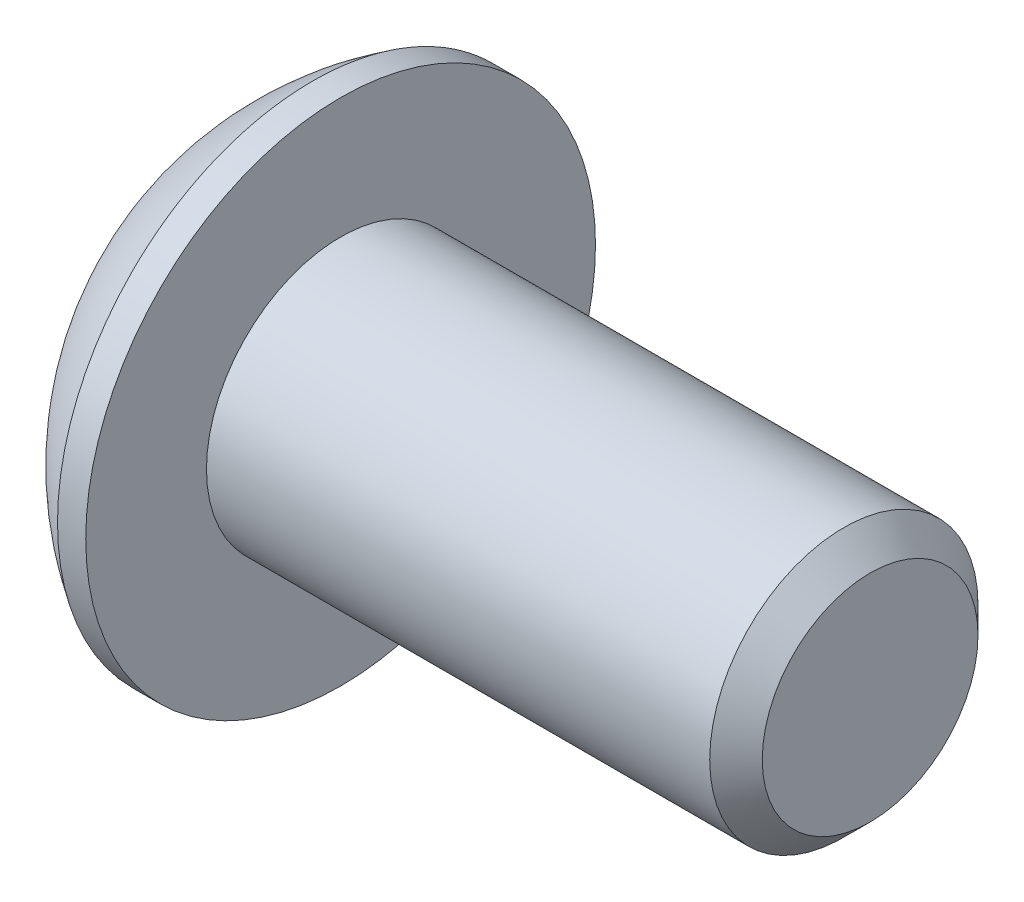
ISO-10303-21;
HEADER;
FILE_DESCRIPTION(('STEP AP214'),'2;1');
FILE_NAME('part.step','',(''),(''),'','','');
FILE_SCHEMA(('AUTOMOTIVE_DESIGN { 1 0 10303 214 1 1 1 1 }'));
ENDSEC;
DATA;
#1=APPLICATION_CONTEXT('core data for automotive mechanical design processes');
#2=APPLICATION_PROTOCOL_DEFINITION('international standard','automotive_design',2000,#1);
#3=PRODUCT_CONTEXT('',#1,'mechanical');
#4=PRODUCT('Part','Part','',(#3));
#5=PRODUCT_RELATED_PRODUCT_CATEGORY('part','',(#4));
#6=PRODUCT_DEFINITION_FORMATION('','',#4);
#7=PRODUCT_DEFINITION_CONTEXT('part definition',#1,'design');
#8=PRODUCT_DEFINITION('design','',#6,#7);
#9=PRODUCT_DEFINITION_SHAPE('','',#8);
#10=(LENGTH_UNIT() NAMED_UNIT(*) SI_UNIT(.MILLI.,.METRE.));
#11=(NAMED_UNIT(*) PLANE_ANGLE_UNIT() SI_UNIT($,.RADIAN.));
#12=(NAMED_UNIT(*) SI_UNIT($,.STERADIAN.) SOLID_ANGLE_UNIT());
#13=UNCERTAINTY_MEASURE_WITH_UNIT(LENGTH_MEASURE(1.E-05),#10,'distance_accuracy_value','');
#14=(GEOMETRIC_REPRESENTATION_CONTEXT(3) GLOBAL_UNCERTAINTY_ASSIGNED_CONTEXT((#13)) GLOBAL_UNIT_ASSIGNED_CONTEXT((#10,
#11,#12)) REPRESENTATION_CONTEXT('',''));
#15=CARTESIAN_POINT('',(0.,0.,0.));
#16=DIRECTION('',(0.,0.,1.));
#17=DIRECTION('',(1.,0.,0.));
#18=AXIS2_PLACEMENT_3D('',#15,#16,#17);
#19=CARTESIAN_POINT('',(1.77800000000006,0.,0.));
#20=DIRECTION('',(-1.,0.,0.));
#21=DIRECTION('',(0.,0.,1.));
#22=AXIS2_PLACEMENT_3D('',#19,#20,#21);
#23=CONICAL_SURFACE('',#22,1.58750000000007,1.04719755119647);
#24=CARTESIAN_POINT('',(2.69454355233878,0.,0.));
#25=VERTEX_POINT('',#24);
#26=VERTEX_LOOP('',#25);
#27=FACE_BOUND('',#26,.T.);
#28=CARTESIAN_POINT('',(1.77800000000006,0.,0.));
#29=DIRECTION('',(-1.,0.,0.));
#30=DIRECTION('',(0.,0.,1.));
#31=AXIS2_PLACEMENT_3D('',#28,#29,#30);
#32=CIRCLE('',#31,1.58750000000007);
#33=CARTESIAN_POINT('',(1.77800000000003,0.,1.58750000000004));
#34=VERTEX_POINT('',#33);
#35=CARTESIAN_POINT('',(1.77800000000003,-1.37481532850783,0.793750000000017));
#36=VERTEX_POINT('',#35);
#37=EDGE_CURVE('E19',#34,#36,#32,.F.);
#38=ORIENTED_EDGE('',*,*,#37,.F.);
#39=CARTESIAN_POINT('',(1.77800000000006,0.,0.));
#40=DIRECTION('',(-1.,0.,0.));
#41=DIRECTION('',(0.,0.,1.));
#42=AXIS2_PLACEMENT_3D('',#39,#40,#41);
#43=CIRCLE('',#42,1.58750000000007);
#44=CARTESIAN_POINT('',(1.77800000000003,1.37481532850783,0.793750000000019));
#45=VERTEX_POINT('',#44);
#46=EDGE_CURVE('E89',#34,#45,#43,.T.);
#47=ORIENTED_EDGE('',*,*,#46,.T.);
#48=CARTESIAN_POINT('',(1.77800000000006,0.,0.));
#49=DIRECTION('',(-1.,0.,0.));
#50=DIRECTION('',(0.,0.,1.));
#51=AXIS2_PLACEMENT_3D('',#48,#49,#50);
#52=CIRCLE('',#51,1.58750000000007);
#53=CARTESIAN_POINT('',(1.77800000000003,1.37481532850783,-0.793750000000019));
#54=VERTEX_POINT('',#53);
#55=EDGE_CURVE('E105',#45,#54,#52,.T.);
#56=ORIENTED_EDGE('',*,*,#55,.T.);
#57=CARTESIAN_POINT('',(1.77800000000006,0.,0.));
#58=DIRECTION('',(-1.,0.,0.));
#59=DIRECTION('',(0.,0.,1.));
#60=AXIS2_PLACEMENT_3D('',#57,#58,#59);
#61=CIRCLE('',#60,1.58750000000007);
#62=CARTESIAN_POINT('',(1.77800000000003,-2.78602967841758E-12,-1.58750000000004));
#63=VERTEX_POINT('',#62);
#64=EDGE_CURVE('E448',#54,#63,#61,.T.);
#65=ORIENTED_EDGE('',*,*,#64,.T.);
#66=CARTESIAN_POINT('',(1.77800000000006,0.,0.));
#67=DIRECTION('',(-1.,0.,0.));
#68=DIRECTION('',(0.,0.,1.));
#69=AXIS2_PLACEMENT_3D('',#66,#67,#68);
#70=CIRCLE('',#69,1.58750000000007);
#71=CARTESIAN_POINT('',(1.77800000000003,-1.37481532850783,-0.793750000000017));
#72=VERTEX_POINT('',#71);
#73=EDGE_CURVE('E450',#72,#63,#70,.F.);
#74=ORIENTED_EDGE('',*,*,#73,.F.);
#75=CARTESIAN_POINT('',(1.77800000000006,0.,0.));
#76=DIRECTION('',(-1.,0.,0.));
#77=DIRECTION('',(0.,0.,1.));
#78=AXIS2_PLACEMENT_3D('',#75,#76,#77);
#79=CIRCLE('',#78,1.58750000000007);
#80=EDGE_CURVE('E92',#36,#72,#79,.F.);
#81=ORIENTED_EDGE('',*,*,#80,.F.);
#82=EDGE_LOOP('',(#38,#47,#56,#65,#74,#81));
#83=FACE_BOUND('',#82,.T.);
#84=ADVANCED_FACE('F16',(#27,#83),#23,.F.);
#85=CARTESIAN_POINT('',(1.778,-2.74963065701559,-1.5875));
#86=DIRECTION('',(1.,0.,0.));
#87=DIRECTION('',(0.,0.,-1.));
#88=AXIS2_PLACEMENT_3D('',#85,#86,#87);
#89=PLANE('',#88);
#90=DIRECTION('',(0.,0.5,0.866025403784439));
#91=VECTOR('',#90,1.);
#92=CARTESIAN_POINT('',(1.778,-1.83308710467706,0.));
#93=LINE('',#92,#91);
#94=CARTESIAN_POINT('',(1.778,-0.91654355233853,1.5875));
#95=VERTEX_POINT('',#94);
#96=EDGE_CURVE('E110',#95,#36,#93,.F.);
#97=ORIENTED_EDGE('',*,*,#96,.F.);
#98=DIRECTION('',(0.,1.,0.));
#99=VECTOR('',#98,1.);
#100=CARTESIAN_POINT('',(1.778,-0.91654355233853,1.5875));
#101=LINE('',#100,#99);
#102=EDGE_CURVE('E108',#34,#95,#101,.F.);
#103=ORIENTED_EDGE('',*,*,#102,.F.);
#104=ORIENTED_EDGE('',*,*,#37,.T.);
#105=EDGE_LOOP('',(#97,#103,#104));
#106=FACE_BOUND('',#105,.T.);
#107=ADVANCED_FACE('F109',(#106),#89,.F.);
#108=CARTESIAN_POINT('',(1.778,-2.74963065701559,-1.5875));
#109=DIRECTION('',(1.,0.,0.));
#110=DIRECTION('',(0.,0.,-1.));
#111=AXIS2_PLACEMENT_3D('',#108,#109,#110);
#112=PLANE('',#111);
#113=DIRECTION('',(0.,-0.5,0.866025403784439));
#114=VECTOR('',#113,1.);
#115=CARTESIAN_POINT('',(1.778,-0.91654355233853,-1.5875));
#116=LINE('',#115,#114);
#117=CARTESIAN_POINT('',(1.778,-1.83308710467706,0.));
#118=VERTEX_POINT('',#117);
#119=EDGE_CURVE('E158',#118,#72,#116,.F.);
#120=ORIENTED_EDGE('',*,*,#119,.F.);
#121=DIRECTION('',(0.,0.5,0.866025403784439));
#122=VECTOR('',#121,1.);
#123=CARTESIAN_POINT('',(1.778,-1.83308710467706,0.));
#124=LINE('',#123,#122);
#125=EDGE_CURVE('E170',#36,#118,#124,.F.);
#126=ORIENTED_EDGE('',*,*,#125,.F.);
#127=ORIENTED_EDGE('',*,*,#80,.T.);
#128=EDGE_LOOP('',(#120,#126,#127));
#129=FACE_BOUND('',#128,.T.);
#130=ADVANCED_FACE('F247',(#129),#112,.F.);
#131=CARTESIAN_POINT('',(1.778,-2.74963065701559,-1.5875));
#132=DIRECTION('',(1.,0.,0.));
#133=DIRECTION('',(0.,0.,-1.));
#134=AXIS2_PLACEMENT_3D('',#131,#132,#133);
#135=PLANE('',#134);
#136=DIRECTION('',(0.,1.,0.));
#137=VECTOR('',#136,1.);
#138=CARTESIAN_POINT('',(1.778,0.916543552338532,-1.5875));
#139=LINE('',#138,#137);
#140=CARTESIAN_POINT('',(1.778,-0.91654355233853,-1.5875));
#141=VERTEX_POINT('',#140);
#142=EDGE_CURVE('E142',#141,#63,#139,.T.);
#143=ORIENTED_EDGE('',*,*,#142,.F.);
#144=DIRECTION('',(0.,-0.5,0.866025403784439));
#145=VECTOR('',#144,1.);
#146=CARTESIAN_POINT('',(1.778,-0.91654355233853,-1.5875));
#147=LINE('',#146,#145);
#148=EDGE_CURVE('E155',#72,#141,#147,.F.);
#149=ORIENTED_EDGE('',*,*,#148,.F.);
#150=ORIENTED_EDGE('',*,*,#73,.T.);
#151=EDGE_LOOP('',(#143,#149,#150));
#152=FACE_BOUND('',#151,.T.);
#153=ADVANCED_FACE('F243',(#152),#135,.F.);
#154=CARTESIAN_POINT('',(1.778,-2.74963065701559,-1.5875));
#155=DIRECTION('',(1.,0.,0.));
#156=DIRECTION('',(0.,0.,-1.));
#157=AXIS2_PLACEMENT_3D('',#154,#155,#156);
#158=PLANE('',#157);
#159=DIRECTION('',(0.,-0.5,-0.866025403784439));
#160=VECTOR('',#159,1.);
#161=CARTESIAN_POINT('',(1.778,1.83308710467706,0.));
#162=LINE('',#161,#160);
#163=CARTESIAN_POINT('',(1.778,0.916543552338532,-1.5875));
#164=VERTEX_POINT('',#163);
#165=EDGE_CURVE('E127',#164,#54,#162,.F.);
#166=ORIENTED_EDGE('',*,*,#165,.F.);
#167=DIRECTION('',(0.,1.,0.));
#168=VECTOR('',#167,1.);
#169=CARTESIAN_POINT('',(1.778,0.916543552338532,-1.5875));
#170=LINE('',#169,#168);
#171=EDGE_CURVE('E139',#63,#164,#170,.T.);
#172=ORIENTED_EDGE('',*,*,#171,.F.);
#173=ORIENTED_EDGE('',*,*,#64,.F.);
#174=EDGE_LOOP('',(#166,#172,#173));
#175=FACE_BOUND('',#174,.T.);
#176=ADVANCED_FACE('F239',(#175),#158,.F.);
#177=CARTESIAN_POINT('',(1.778,-2.74963065701559,-1.5875));
#178=DIRECTION('',(1.,0.,0.));
#179=DIRECTION('',(0.,0.,-1.));
#180=AXIS2_PLACEMENT_3D('',#177,#178,#179);
#181=PLANE('',#180);
#182=DIRECTION('',(0.,0.5,-0.866025403784439));
#183=VECTOR('',#182,1.);
#184=CARTESIAN_POINT('',(1.778,0.916543552338533,1.5875));
#185=LINE('',#184,#183);
#186=CARTESIAN_POINT('',(1.778,1.83308710467706,0.));
#187=VERTEX_POINT('',#186);
#188=EDGE_CURVE('E147',#187,#45,#185,.F.);
#189=ORIENTED_EDGE('',*,*,#188,.F.);
#190=DIRECTION('',(0.,-0.5,-0.866025403784439));
#191=VECTOR('',#190,1.);
#192=CARTESIAN_POINT('',(1.778,1.83308710467706,0.));
#193=LINE('',#192,#191);
#194=EDGE_CURVE('E124',#54,#187,#193,.F.);
#195=ORIENTED_EDGE('',*,*,#194,.F.);
#196=ORIENTED_EDGE('',*,*,#55,.F.);
#197=EDGE_LOOP('',(#189,#195,#196));
#198=FACE_BOUND('',#197,.T.);
#199=ADVANCED_FACE('F236',(#198),#181,.F.);
#200=CARTESIAN_POINT('',(1.778,-2.74963065701559,-1.5875));
#201=DIRECTION('',(1.,0.,0.));
#202=DIRECTION('',(0.,0.,-1.));
#203=AXIS2_PLACEMENT_3D('',#200,#201,#202);
#204=PLANE('',#203);
#205=DIRECTION('',(0.,1.,0.));
#206=VECTOR('',#205,1.);
#207=CARTESIAN_POINT('',(1.778,-0.91654355233853,1.5875));
#208=LINE('',#207,#206);
#209=CARTESIAN_POINT('',(1.778,0.916543552338533,1.5875));
#210=VERTEX_POINT('',#209);
#211=EDGE_CURVE('E100',#210,#34,#208,.F.);
#212=ORIENTED_EDGE('',*,*,#211,.F.);
#213=DIRECTION('',(0.,0.5,-0.866025403784439));
#214=VECTOR('',#213,1.);
#215=CARTESIAN_POINT('',(1.778,0.916543552338533,1.5875));
#216=LINE('',#215,#214);
#217=EDGE_CURVE('E103',#45,#210,#216,.F.);
#218=ORIENTED_EDGE('',*,*,#217,.F.);
#219=ORIENTED_EDGE('',*,*,#46,.F.);
#220=EDGE_LOOP('',(#212,#218,#219));
#221=FACE_BOUND('',#220,.T.);
#222=ADVANCED_FACE('F98',(#221),#204,.F.);
#223=CARTESIAN_POINT('',(1.778,-0.91654355233853,1.5875));
#224=DIRECTION('',(0.,0.,-1.));
#225=DIRECTION('',(0.,1.,0.));
#226=AXIS2_PLACEMENT_3D('',#223,#224,#225);
#227=PLANE('',#226);
#228=DIRECTION('',(0.,1.,0.));
#229=VECTOR('',#228,1.);
#230=CARTESIAN_POINT('',(0.,0.,1.5875));
#231=LINE('',#230,#229);
#232=CARTESIAN_POINT('',(0.,0.916543552338532,1.5875));
#233=VERTEX_POINT('',#232);
#234=CARTESIAN_POINT('',(0.,-0.91654355233853,1.5875));
#235=VERTEX_POINT('',#234);
#236=EDGE_CURVE('E131',#233,#235,#231,.F.);
#237=ORIENTED_EDGE('',*,*,#236,.F.);
#238=DIRECTION('',(1.,0.,0.));
#239=VECTOR('',#238,1.);
#240=CARTESIAN_POINT('',(1.778,0.916543552338533,1.5875));
#241=LINE('',#240,#239);
#242=EDGE_CURVE('E116',#210,#233,#241,.F.);
#243=ORIENTED_EDGE('',*,*,#242,.F.);
#244=ORIENTED_EDGE('',*,*,#211,.T.);
#245=ORIENTED_EDGE('',*,*,#102,.T.);
#246=DIRECTION('',(1.,0.,0.));
#247=VECTOR('',#246,1.);
#248=CARTESIAN_POINT('',(1.778,-0.91654355233853,1.5875));
#249=LINE('',#248,#247);
#250=EDGE_CURVE('E167',#235,#95,#249,.T.);
#251=ORIENTED_EDGE('',*,*,#250,.F.);
#252=EDGE_LOOP('',(#237,#243,#244,#245,#251));
#253=FACE_BOUND('',#252,.T.);
#254=ADVANCED_FACE('F114',(#253),#227,.T.);
#255=CARTESIAN_POINT('',(1.778,-1.83308710467706,0.));
#256=DIRECTION('',(0.,0.866025403784439,-0.5));
#257=DIRECTION('',(0.,0.5,0.866025403784439));
#258=AXIS2_PLACEMENT_3D('',#255,#256,#257);
#259=PLANE('',#258);
#260=DIRECTION('',(0.,-0.5,-0.866025403784439));
#261=VECTOR('',#260,1.);
#262=CARTESIAN_POINT('',(0.,-0.91654355233853,1.5875));
#263=LINE('',#262,#261);
#264=CARTESIAN_POINT('',(0.,-1.83308710467706,0.));
#265=VERTEX_POINT('',#264);
#266=EDGE_CURVE('E434',#235,#265,#263,.T.);
#267=ORIENTED_EDGE('',*,*,#266,.F.);
#268=ORIENTED_EDGE('',*,*,#250,.T.);
#269=ORIENTED_EDGE('',*,*,#96,.T.);
#270=ORIENTED_EDGE('',*,*,#125,.T.);
#271=DIRECTION('',(1.,0.,0.));
#272=VECTOR('',#271,1.);
#273=CARTESIAN_POINT('',(1.778,-1.83308710467706,0.));
#274=LINE('',#273,#272);
#275=EDGE_CURVE('E152',#265,#118,#274,.T.);
#276=ORIENTED_EDGE('',*,*,#275,.F.);
#277=EDGE_LOOP('',(#267,#268,#269,#270,#276));
#278=FACE_BOUND('',#277,.T.);
#279=ADVANCED_FACE('F227',(#278),#259,.T.);
#280=CARTESIAN_POINT('',(1.778,-0.91654355233853,-1.5875));
#281=DIRECTION('',(0.,0.866025403784439,0.5));
#282=DIRECTION('',(0.,-0.5,0.866025403784439));
#283=AXIS2_PLACEMENT_3D('',#280,#281,#282);
#284=PLANE('',#283);
#285=DIRECTION('',(0.,0.5,-0.866025403784439));
#286=VECTOR('',#285,1.);
#287=CARTESIAN_POINT('',(0.,-1.83308710467706,0.));
#288=LINE('',#287,#286);
#289=CARTESIAN_POINT('',(0.,-0.91654355233853,-1.5875));
#290=VERTEX_POINT('',#289);
#291=EDGE_CURVE('E431',#265,#290,#288,.T.);
#292=ORIENTED_EDGE('',*,*,#291,.F.);
#293=ORIENTED_EDGE('',*,*,#275,.T.);
#294=ORIENTED_EDGE('',*,*,#119,.T.);
#295=ORIENTED_EDGE('',*,*,#148,.T.);
#296=DIRECTION('',(1.,0.,0.));
#297=VECTOR('',#296,1.);
#298=CARTESIAN_POINT('',(1.778,-0.91654355233853,-1.5875));
#299=LINE('',#298,#297);
#300=EDGE_CURVE('E136',#290,#141,#299,.T.);
#301=ORIENTED_EDGE('',*,*,#300,.F.);
#302=EDGE_LOOP('',(#292,#293,#294,#295,#301));
#303=FACE_BOUND('',#302,.T.);
#304=ADVANCED_FACE('F223',(#303),#284,.T.);
#305=CARTESIAN_POINT('',(1.778,0.916543552338532,-1.5875));
#306=DIRECTION('',(0.,0.,1.));
#307=DIRECTION('',(1.,0.,0.));
#308=AXIS2_PLACEMENT_3D('',#305,#306,#307);
#309=PLANE('',#308);
#310=DIRECTION('',(0.,1.,0.));
#311=VECTOR('',#310,1.);
#312=CARTESIAN_POINT('',(0.,0.,-1.5875));
#313=LINE('',#312,#311);
#314=CARTESIAN_POINT('',(0.,0.916543552338532,-1.5875));
#315=VERTEX_POINT('',#314);
#316=EDGE_CURVE('E428',#290,#315,#313,.T.);
#317=ORIENTED_EDGE('',*,*,#316,.F.);
#318=ORIENTED_EDGE('',*,*,#300,.T.);
#319=ORIENTED_EDGE('',*,*,#142,.T.);
#320=ORIENTED_EDGE('',*,*,#171,.T.);
#321=DIRECTION('',(1.,0.,0.));
#322=VECTOR('',#321,1.);
#323=CARTESIAN_POINT('',(1.778,0.916543552338532,-1.5875));
#324=LINE('',#323,#322);
#325=EDGE_CURVE('E126',#315,#164,#324,.T.);
#326=ORIENTED_EDGE('',*,*,#325,.F.);
#327=EDGE_LOOP('',(#317,#318,#319,#320,#326));
#328=FACE_BOUND('',#327,.T.);
#329=ADVANCED_FACE('F220',(#328),#309,.T.);
#330=CARTESIAN_POINT('',(1.778,1.83308710467706,0.));
#331=DIRECTION('',(0.,-0.866025403784439,0.5));
#332=DIRECTION('',(0.,-0.5,-0.866025403784439));
#333=AXIS2_PLACEMENT_3D('',#330,#331,#332);
#334=PLANE('',#333);
#335=DIRECTION('',(0.,0.5,0.866025403784438));
#336=VECTOR('',#335,1.);
#337=CARTESIAN_POINT('',(0.,0.916543552338532,-1.5875));
#338=LINE('',#337,#336);
#339=CARTESIAN_POINT('',(0.,1.83308710467706,0.));
#340=VERTEX_POINT('',#339);
#341=EDGE_CURVE('E425',#315,#340,#338,.T.);
#342=ORIENTED_EDGE('',*,*,#341,.F.);
#343=ORIENTED_EDGE('',*,*,#325,.T.);
#344=ORIENTED_EDGE('',*,*,#165,.T.);
#345=ORIENTED_EDGE('',*,*,#194,.T.);
#346=DIRECTION('',(1.,0.,0.));
#347=VECTOR('',#346,1.);
#348=CARTESIAN_POINT('',(1.778,1.83308710467706,0.));
#349=LINE('',#348,#347);
#350=EDGE_CURVE('E34',#340,#187,#349,.T.);
#351=ORIENTED_EDGE('',*,*,#350,.F.);
#352=EDGE_LOOP('',(#342,#343,#344,#345,#351));
#353=FACE_BOUND('',#352,.T.);
#354=ADVANCED_FACE('F216',(#353),#334,.T.);
#355=CARTESIAN_POINT('',(1.778,0.916543552338533,1.5875));
#356=DIRECTION('',(0.,-0.866025403784439,-0.5));
#357=DIRECTION('',(0.,0.5,-0.866025403784439));
#358=AXIS2_PLACEMENT_3D('',#355,#356,#357);
#359=PLANE('',#358);
#360=DIRECTION('',(0.,-0.5,0.866025403784439));
#361=VECTOR('',#360,1.);
#362=CARTESIAN_POINT('',(0.,1.83308710467706,0.));
#363=LINE('',#362,#361);
#364=EDGE_CURVE('E202',#340,#233,#363,.T.);
#365=ORIENTED_EDGE('',*,*,#364,.F.);
#366=ORIENTED_EDGE('',*,*,#350,.T.);
#367=ORIENTED_EDGE('',*,*,#188,.T.);
#368=ORIENTED_EDGE('',*,*,#217,.T.);
#369=ORIENTED_EDGE('',*,*,#242,.T.);
#370=EDGE_LOOP('',(#365,#366,#367,#368,#369));
#371=FACE_BOUND('',#370,.T.);
#372=ADVANCED_FACE('F212',(#371),#359,.T.);
#373=CARTESIAN_POINT('',(0.,0.,0.));
#374=DIRECTION('',(-1.,0.,0.));
#375=DIRECTION('',(0.,0.,1.));
#376=AXIS2_PLACEMENT_3D('',#373,#374,#375);
#377=PLANE('',#376);
#378=ORIENTED_EDGE('',*,*,#341,.T.);
#379=ORIENTED_EDGE('',*,*,#364,.T.);
#380=ORIENTED_EDGE('',*,*,#236,.T.);
#381=ORIENTED_EDGE('',*,*,#266,.T.);
#382=ORIENTED_EDGE('',*,*,#291,.T.);
#383=ORIENTED_EDGE('',*,*,#316,.T.);
#384=EDGE_LOOP('',(#378,#379,#380,#381,#382,#383));
#385=FACE_BOUND('',#384,.T.);
#386=CARTESIAN_POINT('',(0.,2.29235,0.));
#387=CARTESIAN_POINT('',(0.,2.29234961429956,0.0643619991867155));
#388=CARTESIAN_POINT('',(0.,2.28963695190107,0.128735826629365));
#389=CARTESIAN_POINT('',(0.,2.27880393843647,0.257038618985286));
#390=CARTESIAN_POINT('',(0.,2.27068199085126,0.320967446929162));
#391=CARTESIAN_POINT('',(0.,2.24906694794255,0.448021254607717));
#392=CARTESIAN_POINT('',(-2.10840056970795E-13,2.2355653265346,0.51114479338186));
#393=CARTESIAN_POINT('',(2.11879226109671E-13,2.20328400495644,0.636065176149321));
#394=CARTESIAN_POINT('',(7.89917625163527E-13,2.18450002159113,0.697860899533934));
#395=CARTESIAN_POINT('',(1.31285126424162E-12,2.12048422735802,0.880329802927747));
#396=CARTESIAN_POINT('',(0.,2.06753599079459,0.998391795928116));
#397=CARTESIAN_POINT('',(0.,1.94254204858672,1.22393765942147));
#398=CARTESIAN_POINT('',(1.0943500696831E-12,1.87049561696642,1.33142112758208));
#399=CARTESIAN_POINT('',(6.78225420709987E-13,1.7497425419488,1.48237719670935));
#400=CARTESIAN_POINT('',(1.81996039545648E-13,1.707345731323,1.53101280076737));
#401=CARTESIAN_POINT('',(-1.80953624347813E-13,1.61863910291529,1.62450601319185));
#402=CARTESIAN_POINT('',(0.,1.57233309727312,1.66936721890417));
#403=CARTESIAN_POINT('',(0.,1.47608431707233,1.7550488420402));
#404=CARTESIAN_POINT('',(0.,1.42613990458994,1.79586741981512));
#405=CARTESIAN_POINT('',(0.,1.3229945254125,1.87315615311522));
#406=CARTESIAN_POINT('',(0.,1.26979280714187,1.90962529930697));
#407=CARTESIAN_POINT('',(0.,1.10588180153952,2.01207722151089));
#408=CARTESIAN_POINT('',(0.,0.990764947001307,2.07119486286666));
#409=CARTESIAN_POINT('',(0.,0.752302198839713,2.16922858468856));
#410=CARTESIAN_POINT('',(0.,0.628956393121256,2.20814488091449));
#411=CARTESIAN_POINT('',(0.,0.377466101733266,2.2647275576592));
#412=CARTESIAN_POINT('',(0.,0.249321590440377,2.28239382469379));
#413=CARTESIAN_POINT('',(0.,-0.00811435371610997,2.29595665980955));
#414=CARTESIAN_POINT('',(0.,-0.137405786579708,2.29185322789072));
#415=CARTESIAN_POINT('',(0.,-0.393449386933728,2.2620096240906));
#416=CARTESIAN_POINT('',(0.,-0.520201567981086,2.23626956775766));
#417=CARTESIAN_POINT('',(0.,-0.767645294384453,2.16383549332687));
#418=CARTESIAN_POINT('',(0.,-0.888336774993558,2.11714125142685));
#419=CARTESIAN_POINT('',(0.,-1.06210572146656,2.03247976453654));
#420=CARTESIAN_POINT('',(0.,-1.11884498714067,2.00180278323695));
#421=CARTESIAN_POINT('',(0.,-1.22954062855573,1.93578011658036));
#422=CARTESIAN_POINT('',(0.,-1.28349764565393,1.9004355139425));
#423=CARTESIAN_POINT('',(0.,-1.38821676641538,1.82534174602347));
#424=CARTESIAN_POINT('',(0.,-1.43898030563029,1.78559458231503));
#425=CARTESIAN_POINT('',(0.,-1.53701984534432,1.70193996292361));
#426=CARTESIAN_POINT('',(0.,-1.58429243280551,1.65802852924127));
#427=CARTESIAN_POINT('',(0.,-1.72023903553759,1.52059650554139));
#428=CARTESIAN_POINT('',(0.,-1.80318066138239,1.42127847626519));
#429=CARTESIAN_POINT('',(0.,-1.95118232345099,1.21011519784664));
#430=CARTESIAN_POINT('',(0.,-2.01624303935585,1.09827042509272));
#431=CARTESIAN_POINT('',(0.,-2.09907772661315,0.923538238005837));
#432=CARTESIAN_POINT('',(0.,-2.12425103063559,0.864058373981965));
#433=CARTESIAN_POINT('',(0.,-2.16947990046566,0.7432215621756));
#434=CARTESIAN_POINT('',(0.,-2.18953960800685,0.681866178863365));
#435=CARTESIAN_POINT('',(0.,-2.22438542051157,0.557786972400357));
#436=CARTESIAN_POINT('',(0.,-2.23917985294819,0.495065478128173));
#437=CARTESIAN_POINT('',(0.,-2.26343456384454,0.368611258323516));
#438=CARTESIAN_POINT('',(0.,-2.27289641559286,0.30487883675957));
#439=CARTESIAN_POINT('',(0.,-2.28388649696737,0.200873029360625));
#440=CARTESIAN_POINT('',(0.,-2.28705930623294,0.160766164180098));
#441=CARTESIAN_POINT('',(0.,-2.29129117827045,0.0804410725432715));
#442=CARTESIAN_POINT('',(0.,-2.29235024104239,0.0402228460869717));
#443=CARTESIAN_POINT('',(0.,-2.29234961429957,-0.0643619991867168));
#444=CARTESIAN_POINT('',(0.,-2.28963695190109,-0.128735826629366));
#445=CARTESIAN_POINT('',(0.,-2.27880393843648,-0.257038618985287));
#446=CARTESIAN_POINT('',(0.,-2.27068199085127,-0.320967446929163));
#447=CARTESIAN_POINT('',(0.,-2.24906694794256,-0.448021254607718));
#448=CARTESIAN_POINT('',(-2.11158505516439E-13,-2.23556532653461,-0.511144793381861));
#449=CARTESIAN_POINT('',(2.12197933617066E-13,-2.20328400495644,-0.636065176149321));
#450=CARTESIAN_POINT('',(7.91271169771705E-13,-2.18450002159114,-0.697860899533935));
#451=CARTESIAN_POINT('',(1.31534652841856E-12,-2.12048422735803,-0.880329802927748));
#452=CARTESIAN_POINT('',(0.,-2.06753599079459,-0.998391795928114));
#453=CARTESIAN_POINT('',(0.,-1.94254204858673,-1.22393765942147));
#454=CARTESIAN_POINT('',(1.09423089153949E-12,-1.87049561696643,-1.33142112758208));
#455=CARTESIAN_POINT('',(6.78285087865736E-13,-1.74974254194881,-1.48237719670935));
#456=CARTESIAN_POINT('',(1.82011279261461E-13,-1.70734573132301,-1.53101280076737));
#457=CARTESIAN_POINT('',(-1.80968849370244E-13,-1.61863910291529,-1.62450601319185));
#458=CARTESIAN_POINT('',(0.,-1.57233309727313,-1.66936721890417));
#459=CARTESIAN_POINT('',(0.,-1.47608431707234,-1.7550488420402));
#460=CARTESIAN_POINT('',(0.,-1.42613990458995,-1.79586741981512));
#461=CARTESIAN_POINT('',(0.,-1.32299452541251,-1.87315615311522));
#462=CARTESIAN_POINT('',(0.,-1.26979280714188,-1.90962529930696));
#463=CARTESIAN_POINT('',(0.,-1.10588180153952,-2.01207722151089));
#464=CARTESIAN_POINT('',(0.,-0.990764947001314,-2.07119486286666));
#465=CARTESIAN_POINT('',(0.,-0.752302198839721,-2.16922858468856));
#466=CARTESIAN_POINT('',(0.,-0.628956393121265,-2.2081448809145));
#467=CARTESIAN_POINT('',(0.,-0.377466101733274,-2.2647275576592));
#468=CARTESIAN_POINT('',(0.,-0.249321590440385,-2.28239382469379));
#469=CARTESIAN_POINT('',(0.,0.0081143537161019,-2.29595665980955));
#470=CARTESIAN_POINT('',(0.,0.1374057865797,-2.29185322789072));
#471=CARTESIAN_POINT('',(0.,0.39344938693372,-2.2620096240906));
#472=CARTESIAN_POINT('',(0.,0.520201567981077,-2.23626956775766));
#473=CARTESIAN_POINT('',(0.,0.767645294384445,-2.16383549332687));
#474=CARTESIAN_POINT('',(0.,0.88833677499355,-2.11714125142685));
#475=CARTESIAN_POINT('',(0.,1.06210572146656,-2.03247976453654));
#476=CARTESIAN_POINT('',(0.,1.11884498714066,-2.00180278323695));
#477=CARTESIAN_POINT('',(0.,1.22954062855572,-1.93578011658036));
#478=CARTESIAN_POINT('',(0.,1.28349764565392,-1.9004355139425));
#479=CARTESIAN_POINT('',(0.,1.38821676641537,-1.82534174602348));
#480=CARTESIAN_POINT('',(0.,1.43898030563028,-1.78559458231503));
#481=CARTESIAN_POINT('',(0.,1.53701984534431,-1.70193996292361));
#482=CARTESIAN_POINT('',(0.,1.5842924328055,-1.65802852924127));
#483=CARTESIAN_POINT('',(0.,1.72023903553758,-1.52059650554139));
#484=CARTESIAN_POINT('',(0.,1.80318066138238,-1.42127847626519));
#485=CARTESIAN_POINT('',(0.,1.95118232345098,-1.21011519784664));
#486=CARTESIAN_POINT('',(0.,2.01624303935584,-1.09827042509272));
#487=CARTESIAN_POINT('',(0.,2.09907772661315,-0.923538238005838));
#488=CARTESIAN_POINT('',(0.,2.12425103063558,-0.864058373981966));
#489=CARTESIAN_POINT('',(0.,2.16947990046565,-0.7432215621756));
#490=CARTESIAN_POINT('',(0.,2.18953960800684,-0.681866178863365));
#491=CARTESIAN_POINT('',(0.,2.22438542051156,-0.557786972400357));
#492=CARTESIAN_POINT('',(0.,2.23917985294818,-0.495065478128172));
#493=CARTESIAN_POINT('',(0.,2.26343456384453,-0.368611258323515));
#494=CARTESIAN_POINT('',(0.,2.27289641559286,-0.304878836759569));
#495=CARTESIAN_POINT('',(0.,2.28388649696736,-0.200873029360625));
#496=CARTESIAN_POINT('',(0.,2.28705930623293,-0.160766164180098));
#497=CARTESIAN_POINT('',(0.,2.29129117827044,-0.0804410725432719));
#498=CARTESIAN_POINT('',(0.,2.29235024104238,-0.0402228460869725));
#499=CARTESIAN_POINT('',(0.,2.29235,0.));
#500=B_SPLINE_CURVE_WITH_KNOTS('',3,(#386,#387,#388,#389,#390,#391,#392,#393,#394,#395,#396,
#397,#398,#399,#400,#401,#402,#403,#404,#405,#406,#407,#408,#409,#410,#411,#412,#413,#414,#415,
#416,#417,#418,#419,#420,#421,#422,#423,#424,#425,#426,#427,#428,#429,#430,#431,#432,#433,#434,
#435,#436,#437,#438,#439,#440,#441,#442,#443,#444,#445,#446,#447,#448,#449,#450,#451,#452,#453,
#454,#455,#456,#457,#458,#459,#460,#461,#462,#463,#464,#465,#466,#467,#468,#469,#470,#471,#472,
#473,#474,#475,#476,#477,#478,#479,#480,#481,#482,#483,#484,#485,#486,#487,#488,#489,#490,#491,
#492,#493,#494,#495,#496,#497,#498,#499),.UNSPECIFIED.,.T.,.F.,(4,2,2,2,2,2,2,2,2,2,2,2,2,2,2,2,
2,2,2,2,2,2,2,2,2,2,2,2,2,2,2,2,2,2,2,2,2,2,2,2,2,2,2,2,2,2,2,2,2,2,2,2,2,2,2,2,4),(0.,
0.193048968618033,0.386154939782395,0.579568183995958,0.773138711491038,1.15935703864577,
1.54559004914645,1.73895960916368,1.93214273180063,2.12541336477221,2.31872876140888,
2.70495649282618,3.09118009906583,3.47740576789431,3.86363143672285,4.24985504296253,
4.63608277437979,4.82939817101619,5.02266880398748,5.2158519266242,5.40922148664122,
5.79545449714217,6.18167282429724,6.37524335179261,6.56865659600641,6.76176256717089,
6.95481153578908,7.07545693291922,7.19610233004937,7.3891512986674,7.58225726983176,
7.77567051404533,7.96924104154041,8.35545936869514,8.74169237919581,8.93506193921305,
9.12824506185,9.32151569482158,9.51483109145825,9.90105882287555,10.2872824291152,
10.6735080979437,11.0597337667722,11.4459573730119,11.8321851044292,12.0255005010656,
12.2187711340368,12.4119542566736,12.6053238166906,12.9915568271915,13.3777751543466,
13.571345681842,13.7647589260558,13.9578648972203,14.1509138658384,14.2715592629686,
14.3922046600987),.UNSPECIFIED.);
#501=CARTESIAN_POINT('',(0.,2.29235,0.));
#502=VERTEX_POINT('',#501);
#503=EDGE_CURVE('E196',#502,#502,#500,.T.);
#504=ORIENTED_EDGE('',*,*,#503,.F.);
#505=EDGE_LOOP('',(#504));
#506=FACE_BOUND('',#505,.T.);
#507=ADVANCED_FACE('F208',(#385,#506),#377,.T.);
#508=CARTESIAN_POINT('',(4.85989606481482,0.,0.));
#509=DIRECTION('',(0.,1.,0.));
#510=DIRECTION('',(1.,0.,0.));
#511=AXIS2_PLACEMENT_3D('',#508,#509,#510);
#512=SPHERICAL_SURFACE('',#511,5.37340285883187);
#513=CARTESIAN_POINT('',(2.0574,0.,0.));
#514=DIRECTION('',(-1.,0.,0.));
#515=DIRECTION('',(0.,0.,1.));
#516=AXIS2_PLACEMENT_3D('',#513,#514,#515);
#517=CIRCLE('',#516,4.5847);
#518=CARTESIAN_POINT('',(2.0574,0.,4.5847));
#519=VERTEX_POINT('',#518);
#520=EDGE_CURVE('E193',#519,#519,#517,.F.);
#521=ORIENTED_EDGE('',*,*,#520,.F.);
#522=EDGE_LOOP('',(#521));
#523=FACE_BOUND('',#522,.T.);
#524=ORIENTED_EDGE('',*,*,#503,.T.);
#525=EDGE_LOOP('',(#524));
#526=FACE_BOUND('',#525,.T.);
#527=ADVANCED_FACE('F204',(#523,#526),#512,.T.);
#528=CARTESIAN_POINT('',(12.0904,0.,0.));
#529=DIRECTION('',(-1.,0.,0.));
#530=DIRECTION('',(0.,0.,1.));
#531=AXIS2_PLACEMENT_3D('',#528,#529,#530);
#532=PLANE('',#531);
#533=CARTESIAN_POINT('',(12.09039999992,0.,0.));
#534=DIRECTION('',(-1.,0.,0.));
#535=DIRECTION('',(0.,0.,1.));
#536=AXIS2_PLACEMENT_3D('',#533,#534,#535);
#537=CIRCLE('',#536,1.94055999998);
#538=CARTESIAN_POINT('',(12.09039999992,0.,1.94055999998));
#539=VERTEX_POINT('',#538);
#540=EDGE_CURVE('E190',#539,#539,#537,.T.);
#541=ORIENTED_EDGE('',*,*,#540,.F.);
#542=EDGE_LOOP('',(#541));
#543=FACE_BOUND('',#542,.T.);
#544=ADVANCED_FACE('F275',(#543),#532,.F.);
#545=CARTESIAN_POINT('',(0.,0.,0.));
#546=DIRECTION('',(-1.,0.,0.));
#547=DIRECTION('',(0.,0.,1.));
#548=AXIS2_PLACEMENT_3D('',#545,#546,#547);
#549=CYLINDRICAL_SURFACE('',#548,4.5847);
#550=ORIENTED_EDGE('',*,*,#520,.T.);
#551=EDGE_LOOP('',(#550));
#552=FACE_BOUND('',#551,.T.);
#553=CARTESIAN_POINT('',(2.5654,0.,0.));
#554=DIRECTION('',(-1.,0.,0.));
#555=DIRECTION('',(0.,0.,1.));
#556=AXIS2_PLACEMENT_3D('',#553,#554,#555);
#557=CIRCLE('',#556,4.5847);
#558=CARTESIAN_POINT('',(2.5654,0.,4.5847));
#559=VERTEX_POINT('',#558);
#560=EDGE_CURVE('E187',#559,#559,#557,.T.);
#561=ORIENTED_EDGE('',*,*,#560,.T.);
#562=EDGE_LOOP('',(#561));
#563=FACE_BOUND('',#562,.T.);
#564=ADVANCED_FACE('F272',(#552,#563),#549,.T.);
#565=CARTESIAN_POINT('',(11.6179599999668,0.,0.));
#566=DIRECTION('',(-1.,0.,0.));
#567=DIRECTION('',(0.,0.,1.));
#568=AXIS2_PLACEMENT_3D('',#565,#566,#567);
#569=CONICAL_SURFACE('',#568,2.41299999993316,0.785398163397448);
#570=CARTESIAN_POINT('',(11.61796,0.,0.));
#571=DIRECTION('',(-1.,0.,0.));
#572=DIRECTION('',(0.,0.,1.));
#573=AXIS2_PLACEMENT_3D('',#570,#571,#572);
#574=CIRCLE('',#573,2.413);
#575=CARTESIAN_POINT('',(11.61796,0.,2.413));
#576=VERTEX_POINT('',#575);
#577=EDGE_CURVE('E25',#576,#576,#574,.T.);
#578=ORIENTED_EDGE('',*,*,#577,.F.);
#579=EDGE_LOOP('',(#578));
#580=FACE_BOUND('',#579,.T.);
#581=ORIENTED_EDGE('',*,*,#540,.T.);
#582=EDGE_LOOP('',(#581));
#583=FACE_BOUND('',#582,.T.);
#584=ADVANCED_FACE('F265',(#580,#583),#569,.T.);
#585=CARTESIAN_POINT('',(2.5654,2.41299999999999,0.));
#586=DIRECTION('',(-1.,0.,0.));
#587=DIRECTION('',(0.,0.,1.));
#588=AXIS2_PLACEMENT_3D('',#585,#586,#587);
#589=PLANE('',#588);
#590=CARTESIAN_POINT('',(2.5654,0.,0.));
#591=DIRECTION('',(-1.,0.,0.));
#592=DIRECTION('',(0.,0.,1.));
#593=AXIS2_PLACEMENT_3D('',#590,#591,#592);
#594=CIRCLE('',#593,2.413);
#595=CARTESIAN_POINT('',(2.5654,0.,2.413));
#596=VERTEX_POINT('',#595);
#597=EDGE_CURVE('E11',#596,#596,#594,.F.);
#598=ORIENTED_EDGE('',*,*,#597,.F.);
#599=EDGE_LOOP('',(#598));
#600=FACE_BOUND('',#599,.T.);
#601=ORIENTED_EDGE('',*,*,#560,.F.);
#602=EDGE_LOOP('',(#601));
#603=FACE_BOUND('',#602,.T.);
#604=ADVANCED_FACE('F259',(#600,#603),#589,.F.);
#605=CARTESIAN_POINT('',(0.,0.,0.));
#606=DIRECTION('',(-1.,0.,0.));
#607=DIRECTION('',(0.,0.,1.));
#608=AXIS2_PLACEMENT_3D('',#605,#606,#607);
#609=CYLINDRICAL_SURFACE('',#608,2.413);
#610=ORIENTED_EDGE('',*,*,#597,.T.);
#611=EDGE_LOOP('',(#610));
#612=FACE_BOUND('',#611,.T.);
#613=ORIENTED_EDGE('',*,*,#577,.T.);
#614=EDGE_LOOP('',(#613));
#615=FACE_BOUND('',#614,.T.);
#616=ADVANCED_FACE('F257',(#612,#615),#609,.T.);
#617=CLOSED_SHELL('',(#84,#107,#130,#153,#176,#199,#222,#254,#279,#304,#329,#354,#372,#507,#527,
#544,#564,#584,#604,#616));
#618=MANIFOLD_SOLID_BREP('B1',#617);
#619=ADVANCED_BREP_SHAPE_REPRESENTATION('',(#18,#618),#14);
#620=SHAPE_DEFINITION_REPRESENTATION(#9,#619);
ENDSEC;
END-ISO-10303-21;
